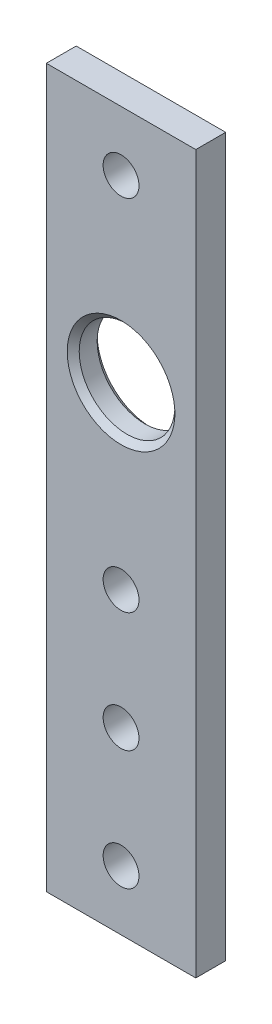
ISO-10303-21;
HEADER;
FILE_DESCRIPTION(('STEP AP214'),'2;1');
FILE_NAME('part.step','',(''),(''),'','','');
FILE_SCHEMA(('AUTOMOTIVE_DESIGN { 1 0 10303 214 1 1 1 1 }'));
ENDSEC;
DATA;
#1=APPLICATION_CONTEXT('core data for automotive mechanical design processes');
#2=APPLICATION_PROTOCOL_DEFINITION('international standard','automotive_design',2000,#1);
#3=PRODUCT_CONTEXT('',#1,'mechanical');
#4=PRODUCT('Part','Part','',(#3));
#5=PRODUCT_RELATED_PRODUCT_CATEGORY('part','',(#4));
#6=PRODUCT_DEFINITION_FORMATION('','',#4);
#7=PRODUCT_DEFINITION_CONTEXT('part definition',#1,'design');
#8=PRODUCT_DEFINITION('design','',#6,#7);
#9=PRODUCT_DEFINITION_SHAPE('','',#8);
#10=(LENGTH_UNIT() NAMED_UNIT(*) SI_UNIT(.MILLI.,.METRE.));
#11=(NAMED_UNIT(*) PLANE_ANGLE_UNIT() SI_UNIT($,.RADIAN.));
#12=(NAMED_UNIT(*) SI_UNIT($,.STERADIAN.) SOLID_ANGLE_UNIT());
#13=UNCERTAINTY_MEASURE_WITH_UNIT(LENGTH_MEASURE(1.E-05),#10,'distance_accuracy_value','');
#14=(GEOMETRIC_REPRESENTATION_CONTEXT(3) GLOBAL_UNCERTAINTY_ASSIGNED_CONTEXT((#13)) GLOBAL_UNIT_ASSIGNED_CONTEXT((#10,
#11,#12)) REPRESENTATION_CONTEXT('',''));
#15=CARTESIAN_POINT('',(0.,0.,0.));
#16=DIRECTION('',(0.,0.,1.));
#17=DIRECTION('',(1.,0.,0.));
#18=AXIS2_PLACEMENT_3D('',#15,#16,#17);
#19=CARTESIAN_POINT('',(0.,0.,5.));
#20=DIRECTION('',(0.,0.,-1.));
#21=DIRECTION('',(-1.,0.,0.));
#22=AXIS2_PLACEMENT_3D('',#19,#20,#21);
#23=PLANE('',#22);
#24=CARTESIAN_POINT('',(12.5,80.,5.));
#25=DIRECTION('',(0.,0.,-1.));
#26=DIRECTION('',(-1.,0.,0.));
#27=AXIS2_PLACEMENT_3D('',#24,#25,#26);
#28=CIRCLE('',#27,9.00000000000002);
#29=CARTESIAN_POINT('',(3.49999999999997,80.,5.));
#30=VERTEX_POINT('',#29);
#31=EDGE_CURVE('E11',#30,#30,#28,.T.);
#32=ORIENTED_EDGE('',*,*,#31,.T.);
#33=EDGE_LOOP('',(#32));
#34=FACE_BOUND('',#33,.T.);
#35=DIRECTION('',(0.,-1.,0.));
#36=VECTOR('',#35,1.);
#37=CARTESIAN_POINT('',(0.,0.,5.));
#38=LINE('',#37,#36);
#39=CARTESIAN_POINT('',(0.,120.,5.));
#40=VERTEX_POINT('',#39);
#41=CARTESIAN_POINT('',(0.,0.,5.));
#42=VERTEX_POINT('',#41);
#43=EDGE_CURVE('E96',#40,#42,#38,.T.);
#44=ORIENTED_EDGE('',*,*,#43,.T.);
#45=DIRECTION('',(1.,0.,0.));
#46=VECTOR('',#45,1.);
#47=CARTESIAN_POINT('',(0.,0.,5.));
#48=LINE('',#47,#46);
#49=CARTESIAN_POINT('',(25.,0.,5.));
#50=VERTEX_POINT('',#49);
#51=EDGE_CURVE('E91',#42,#50,#48,.T.);
#52=ORIENTED_EDGE('',*,*,#51,.T.);
#53=DIRECTION('',(0.,1.,0.));
#54=VECTOR('',#53,1.);
#55=CARTESIAN_POINT('',(25.,0.,5.));
#56=LINE('',#55,#54);
#57=CARTESIAN_POINT('',(25.,120.,5.));
#58=VERTEX_POINT('',#57);
#59=EDGE_CURVE('E94',#50,#58,#56,.T.);
#60=ORIENTED_EDGE('',*,*,#59,.T.);
#61=DIRECTION('',(-1.,0.,0.));
#62=VECTOR('',#61,1.);
#63=CARTESIAN_POINT('',(0.,120.,5.));
#64=LINE('',#63,#62);
#65=EDGE_CURVE('E60',#58,#40,#64,.T.);
#66=ORIENTED_EDGE('',*,*,#65,.T.);
#67=EDGE_LOOP('',(#44,#52,#60,#66));
#68=FACE_BOUND('',#67,.T.);
#69=CARTESIAN_POINT('',(12.5,110.,5.));
#70=DIRECTION('',(0.,0.,1.));
#71=DIRECTION('',(1.,0.,0.));
#72=AXIS2_PLACEMENT_3D('',#69,#70,#71);
#73=CIRCLE('',#72,3.);
#74=CARTESIAN_POINT('',(15.5,110.,5.));
#75=VERTEX_POINT('',#74);
#76=EDGE_CURVE('E119',#75,#75,#73,.T.);
#77=ORIENTED_EDGE('',*,*,#76,.F.);
#78=EDGE_LOOP('',(#77));
#79=FACE_BOUND('',#78,.T.);
#80=CARTESIAN_POINT('',(12.5,50.,5.));
#81=DIRECTION('',(0.,0.,1.));
#82=DIRECTION('',(1.,0.,0.));
#83=AXIS2_PLACEMENT_3D('',#80,#81,#82);
#84=CIRCLE('',#83,3.);
#85=CARTESIAN_POINT('',(15.5,50.,5.));
#86=VERTEX_POINT('',#85);
#87=EDGE_CURVE('E188',#86,#86,#84,.T.);
#88=ORIENTED_EDGE('',*,*,#87,.F.);
#89=EDGE_LOOP('',(#88));
#90=FACE_BOUND('',#89,.T.);
#91=CARTESIAN_POINT('',(12.5,30.,5.));
#92=DIRECTION('',(0.,0.,1.));
#93=DIRECTION('',(1.,0.,0.));
#94=AXIS2_PLACEMENT_3D('',#91,#92,#93);
#95=CIRCLE('',#94,3.);
#96=CARTESIAN_POINT('',(15.5,30.,5.));
#97=VERTEX_POINT('',#96);
#98=EDGE_CURVE('E182',#97,#97,#95,.T.);
#99=ORIENTED_EDGE('',*,*,#98,.F.);
#100=EDGE_LOOP('',(#99));
#101=FACE_BOUND('',#100,.T.);
#102=CARTESIAN_POINT('',(12.5,10.,5.));
#103=DIRECTION('',(0.,0.,1.));
#104=DIRECTION('',(1.,0.,0.));
#105=AXIS2_PLACEMENT_3D('',#102,#103,#104);
#106=CIRCLE('',#105,3.);
#107=CARTESIAN_POINT('',(15.5,10.,5.));
#108=VERTEX_POINT('',#107);
#109=EDGE_CURVE('E176',#108,#108,#106,.T.);
#110=ORIENTED_EDGE('',*,*,#109,.F.);
#111=EDGE_LOOP('',(#110));
#112=FACE_BOUND('',#111,.T.);
#113=ADVANCED_FACE('F41',(#34,#68,#79,#90,#101,#112),#23,.F.);
#114=CARTESIAN_POINT('',(0.,0.,0.));
#115=DIRECTION('',(0.,0.,-1.));
#116=DIRECTION('',(-1.,0.,0.));
#117=AXIS2_PLACEMENT_3D('',#114,#115,#116);
#118=PLANE('',#117);
#119=CARTESIAN_POINT('',(12.5,80.,0.));
#120=DIRECTION('',(0.,0.,-1.));
#121=DIRECTION('',(-1.,0.,0.));
#122=AXIS2_PLACEMENT_3D('',#119,#120,#121);
#123=CIRCLE('',#122,9.00000000000001);
#124=CARTESIAN_POINT('',(3.49999999999999,80.,0.));
#125=VERTEX_POINT('',#124);
#126=EDGE_CURVE('E132',#125,#125,#123,.F.);
#127=ORIENTED_EDGE('',*,*,#126,.T.);
#128=EDGE_LOOP('',(#127));
#129=FACE_BOUND('',#128,.T.);
#130=CARTESIAN_POINT('',(12.5,30.,0.));
#131=DIRECTION('',(0.,0.,1.));
#132=DIRECTION('',(1.,0.,0.));
#133=AXIS2_PLACEMENT_3D('',#130,#131,#132);
#134=CIRCLE('',#133,3.);
#135=CARTESIAN_POINT('',(15.5,30.,0.));
#136=VERTEX_POINT('',#135);
#137=EDGE_CURVE('E160',#136,#136,#134,.T.);
#138=ORIENTED_EDGE('',*,*,#137,.T.);
#139=EDGE_LOOP('',(#138));
#140=FACE_BOUND('',#139,.T.);
#141=DIRECTION('',(0.,-1.,0.));
#142=VECTOR('',#141,1.);
#143=CARTESIAN_POINT('',(0.,0.,0.));
#144=LINE('',#143,#142);
#145=CARTESIAN_POINT('',(0.,120.,0.));
#146=VERTEX_POINT('',#145);
#147=CARTESIAN_POINT('',(0.,0.,0.));
#148=VERTEX_POINT('',#147);
#149=EDGE_CURVE('E115',#146,#148,#144,.T.);
#150=ORIENTED_EDGE('',*,*,#149,.F.);
#151=DIRECTION('',(-1.,0.,0.));
#152=VECTOR('',#151,1.);
#153=CARTESIAN_POINT('',(0.,120.,0.));
#154=LINE('',#153,#152);
#155=CARTESIAN_POINT('',(25.,120.,0.));
#156=VERTEX_POINT('',#155);
#157=EDGE_CURVE('E83',#156,#146,#154,.T.);
#158=ORIENTED_EDGE('',*,*,#157,.F.);
#159=DIRECTION('',(0.,1.,0.));
#160=VECTOR('',#159,1.);
#161=CARTESIAN_POINT('',(25.,0.,0.));
#162=LINE('',#161,#160);
#163=CARTESIAN_POINT('',(25.,0.,0.));
#164=VERTEX_POINT('',#163);
#165=EDGE_CURVE('E77',#164,#156,#162,.T.);
#166=ORIENTED_EDGE('',*,*,#165,.F.);
#167=DIRECTION('',(1.,0.,0.));
#168=VECTOR('',#167,1.);
#169=CARTESIAN_POINT('',(0.,0.,0.));
#170=LINE('',#169,#168);
#171=EDGE_CURVE('E102',#148,#164,#170,.T.);
#172=ORIENTED_EDGE('',*,*,#171,.F.);
#173=EDGE_LOOP('',(#150,#158,#166,#172));
#174=FACE_BOUND('',#173,.T.);
#175=CARTESIAN_POINT('',(12.5,110.,0.));
#176=DIRECTION('',(0.,0.,1.));
#177=DIRECTION('',(1.,0.,0.));
#178=AXIS2_PLACEMENT_3D('',#175,#176,#177);
#179=CIRCLE('',#178,3.);
#180=CARTESIAN_POINT('',(15.5,110.,0.));
#181=VERTEX_POINT('',#180);
#182=EDGE_CURVE('E166',#181,#181,#179,.T.);
#183=ORIENTED_EDGE('',*,*,#182,.T.);
#184=EDGE_LOOP('',(#183));
#185=FACE_BOUND('',#184,.T.);
#186=CARTESIAN_POINT('',(12.5,50.,0.));
#187=DIRECTION('',(0.,0.,1.));
#188=DIRECTION('',(1.,0.,0.));
#189=AXIS2_PLACEMENT_3D('',#186,#187,#188);
#190=CIRCLE('',#189,3.);
#191=CARTESIAN_POINT('',(15.5,50.,0.));
#192=VERTEX_POINT('',#191);
#193=EDGE_CURVE('E170',#192,#192,#190,.T.);
#194=ORIENTED_EDGE('',*,*,#193,.T.);
#195=EDGE_LOOP('',(#194));
#196=FACE_BOUND('',#195,.T.);
#197=CARTESIAN_POINT('',(12.5,10.,0.));
#198=DIRECTION('',(0.,0.,1.));
#199=DIRECTION('',(1.,0.,0.));
#200=AXIS2_PLACEMENT_3D('',#197,#198,#199);
#201=CIRCLE('',#200,3.);
#202=CARTESIAN_POINT('',(15.5,10.,0.));
#203=VERTEX_POINT('',#202);
#204=EDGE_CURVE('E173',#203,#203,#201,.T.);
#205=ORIENTED_EDGE('',*,*,#204,.T.);
#206=EDGE_LOOP('',(#205));
#207=FACE_BOUND('',#206,.T.);
#208=ADVANCED_FACE('F152',(#129,#140,#174,#185,#196,#207),#118,.T.);
#209=CARTESIAN_POINT('',(0.,0.,5.));
#210=DIRECTION('',(1.,0.,0.));
#211=DIRECTION('',(0.,0.,-1.));
#212=AXIS2_PLACEMENT_3D('',#209,#210,#211);
#213=PLANE('',#212);
#214=ORIENTED_EDGE('',*,*,#149,.T.);
#215=DIRECTION('',(0.,0.,-1.));
#216=VECTOR('',#215,1.);
#217=CARTESIAN_POINT('',(0.,0.,5.));
#218=LINE('',#217,#216);
#219=EDGE_CURVE('E104',#42,#148,#218,.T.);
#220=ORIENTED_EDGE('',*,*,#219,.F.);
#221=ORIENTED_EDGE('',*,*,#43,.F.);
#222=DIRECTION('',(0.,0.,-1.));
#223=VECTOR('',#222,1.);
#224=CARTESIAN_POINT('',(0.,120.,5.));
#225=LINE('',#224,#223);
#226=EDGE_CURVE('E111',#40,#146,#225,.T.);
#227=ORIENTED_EDGE('',*,*,#226,.T.);
#228=EDGE_LOOP('',(#214,#220,#221,#227));
#229=FACE_BOUND('',#228,.T.);
#230=ADVANCED_FACE('F155',(#229),#213,.F.);
#231=CARTESIAN_POINT('',(0.,0.,5.));
#232=DIRECTION('',(0.,1.,0.));
#233=DIRECTION('',(0.,0.,1.));
#234=AXIS2_PLACEMENT_3D('',#231,#232,#233);
#235=PLANE('',#234);
#236=ORIENTED_EDGE('',*,*,#171,.T.);
#237=DIRECTION('',(0.,0.,-1.));
#238=VECTOR('',#237,1.);
#239=CARTESIAN_POINT('',(25.,0.,5.));
#240=LINE('',#239,#238);
#241=EDGE_CURVE('E100',#50,#164,#240,.T.);
#242=ORIENTED_EDGE('',*,*,#241,.F.);
#243=ORIENTED_EDGE('',*,*,#51,.F.);
#244=ORIENTED_EDGE('',*,*,#219,.T.);
#245=EDGE_LOOP('',(#236,#242,#243,#244));
#246=FACE_BOUND('',#245,.T.);
#247=ADVANCED_FACE('F101',(#246),#235,.F.);
#248=CARTESIAN_POINT('',(25.,0.,5.));
#249=DIRECTION('',(-1.,0.,0.));
#250=DIRECTION('',(0.,0.,1.));
#251=AXIS2_PLACEMENT_3D('',#248,#249,#250);
#252=PLANE('',#251);
#253=ORIENTED_EDGE('',*,*,#165,.T.);
#254=DIRECTION('',(0.,0.,-1.));
#255=VECTOR('',#254,1.);
#256=CARTESIAN_POINT('',(25.,120.,5.));
#257=LINE('',#256,#255);
#258=EDGE_CURVE('E105',#58,#156,#257,.T.);
#259=ORIENTED_EDGE('',*,*,#258,.F.);
#260=ORIENTED_EDGE('',*,*,#59,.F.);
#261=ORIENTED_EDGE('',*,*,#241,.T.);
#262=EDGE_LOOP('',(#253,#259,#260,#261));
#263=FACE_BOUND('',#262,.T.);
#264=ADVANCED_FACE('F107',(#263),#252,.F.);
#265=CARTESIAN_POINT('',(0.,120.,5.));
#266=DIRECTION('',(0.,-1.,0.));
#267=DIRECTION('',(0.,0.,-1.));
#268=AXIS2_PLACEMENT_3D('',#265,#266,#267);
#269=PLANE('',#268);
#270=ORIENTED_EDGE('',*,*,#157,.T.);
#271=ORIENTED_EDGE('',*,*,#226,.F.);
#272=ORIENTED_EDGE('',*,*,#65,.F.);
#273=ORIENTED_EDGE('',*,*,#258,.T.);
#274=EDGE_LOOP('',(#270,#271,#272,#273));
#275=FACE_BOUND('',#274,.T.);
#276=ADVANCED_FACE('F229',(#275),#269,.F.);
#277=CARTESIAN_POINT('',(12.5,110.,5.));
#278=DIRECTION('',(0.,0.,-1.));
#279=DIRECTION('',(-1.,0.,0.));
#280=AXIS2_PLACEMENT_3D('',#277,#278,#279);
#281=CYLINDRICAL_SURFACE('',#280,3.);
#282=ORIENTED_EDGE('',*,*,#76,.T.);
#283=EDGE_LOOP('',(#282));
#284=FACE_BOUND('',#283,.T.);
#285=ORIENTED_EDGE('',*,*,#182,.F.);
#286=EDGE_LOOP('',(#285));
#287=FACE_BOUND('',#286,.T.);
#288=ADVANCED_FACE('F201',(#284,#287),#281,.F.);
#289=CARTESIAN_POINT('',(12.5,80.,5.));
#290=DIRECTION('',(0.,0.,-1.));
#291=DIRECTION('',(-1.,0.,0.));
#292=AXIS2_PLACEMENT_3D('',#289,#290,#291);
#293=CYLINDRICAL_SURFACE('',#292,8.00000000000001);
#294=CARTESIAN_POINT('',(12.5,80.,1.00000000000002));
#295=DIRECTION('',(0.,0.,-1.));
#296=DIRECTION('',(-1.,0.,0.));
#297=AXIS2_PLACEMENT_3D('',#294,#295,#296);
#298=CIRCLE('',#297,8.00000000000001);
#299=CARTESIAN_POINT('',(4.49999999999999,80.,1.00000000000002));
#300=VERTEX_POINT('',#299);
#301=EDGE_CURVE('E52',#300,#300,#298,.T.);
#302=ORIENTED_EDGE('',*,*,#301,.T.);
#303=EDGE_LOOP('',(#302));
#304=FACE_BOUND('',#303,.T.);
#305=CARTESIAN_POINT('',(12.5,80.,3.99999999999997));
#306=DIRECTION('',(0.,0.,-1.));
#307=DIRECTION('',(-1.,0.,0.));
#308=AXIS2_PLACEMENT_3D('',#305,#306,#307);
#309=CIRCLE('',#308,8.00000000000001);
#310=CARTESIAN_POINT('',(4.49999999999999,80.,3.99999999999997));
#311=VERTEX_POINT('',#310);
#312=EDGE_CURVE('E136',#311,#311,#309,.F.);
#313=ORIENTED_EDGE('',*,*,#312,.T.);
#314=EDGE_LOOP('',(#313));
#315=FACE_BOUND('',#314,.T.);
#316=ADVANCED_FACE('F143',(#304,#315),#293,.F.);
#317=CARTESIAN_POINT('',(12.5,50.,5.));
#318=DIRECTION('',(0.,0.,-1.));
#319=DIRECTION('',(-1.,0.,0.));
#320=AXIS2_PLACEMENT_3D('',#317,#318,#319);
#321=CYLINDRICAL_SURFACE('',#320,3.);
#322=ORIENTED_EDGE('',*,*,#87,.T.);
#323=EDGE_LOOP('',(#322));
#324=FACE_BOUND('',#323,.T.);
#325=ORIENTED_EDGE('',*,*,#193,.F.);
#326=EDGE_LOOP('',(#325));
#327=FACE_BOUND('',#326,.T.);
#328=ADVANCED_FACE('F219',(#324,#327),#321,.F.);
#329=CARTESIAN_POINT('',(12.5,30.,5.));
#330=DIRECTION('',(0.,0.,-1.));
#331=DIRECTION('',(-1.,0.,0.));
#332=AXIS2_PLACEMENT_3D('',#329,#330,#331);
#333=CYLINDRICAL_SURFACE('',#332,3.);
#334=ORIENTED_EDGE('',*,*,#98,.T.);
#335=EDGE_LOOP('',(#334));
#336=FACE_BOUND('',#335,.T.);
#337=ORIENTED_EDGE('',*,*,#137,.F.);
#338=EDGE_LOOP('',(#337));
#339=FACE_BOUND('',#338,.T.);
#340=ADVANCED_FACE('F214',(#336,#339),#333,.F.);
#341=CARTESIAN_POINT('',(12.5,10.,5.));
#342=DIRECTION('',(0.,0.,-1.));
#343=DIRECTION('',(-1.,0.,0.));
#344=AXIS2_PLACEMENT_3D('',#341,#342,#343);
#345=CYLINDRICAL_SURFACE('',#344,3.);
#346=ORIENTED_EDGE('',*,*,#109,.T.);
#347=EDGE_LOOP('',(#346));
#348=FACE_BOUND('',#347,.T.);
#349=ORIENTED_EDGE('',*,*,#204,.F.);
#350=EDGE_LOOP('',(#349));
#351=FACE_BOUND('',#350,.T.);
#352=ADVANCED_FACE('F149',(#348,#351),#345,.F.);
#353=CARTESIAN_POINT('',(12.5,80.,0.));
#354=DIRECTION('',(0.,0.,-1.));
#355=DIRECTION('',(-1.,0.,0.));
#356=AXIS2_PLACEMENT_3D('',#353,#354,#355);
#357=CONICAL_SURFACE('',#356,9.00000000000001,0.785398163397441);
#358=ORIENTED_EDGE('',*,*,#301,.F.);
#359=EDGE_LOOP('',(#358));
#360=FACE_BOUND('',#359,.T.);
#361=ORIENTED_EDGE('',*,*,#126,.F.);
#362=EDGE_LOOP('',(#361));
#363=FACE_BOUND('',#362,.T.);
#364=ADVANCED_FACE('F146',(#360,#363),#357,.F.);
#365=CARTESIAN_POINT('',(12.5,80.,3.99999999999997));
#366=DIRECTION('',(0.,0.,1.));
#367=DIRECTION('',(1.,0.,0.));
#368=AXIS2_PLACEMENT_3D('',#365,#366,#367);
#369=CONICAL_SURFACE('',#368,8.00000000000001,0.785398163397441);
#370=ORIENTED_EDGE('',*,*,#31,.F.);
#371=EDGE_LOOP('',(#370));
#372=FACE_BOUND('',#371,.T.);
#373=ORIENTED_EDGE('',*,*,#312,.F.);
#374=EDGE_LOOP('',(#373));
#375=FACE_BOUND('',#374,.T.);
#376=ADVANCED_FACE('F44',(#372,#375),#369,.F.);
#377=CLOSED_SHELL('',(#113,#208,#230,#247,#264,#276,#288,#316,#328,#340,#352,#364,#376));
#378=MANIFOLD_SOLID_BREP('B2',#377);
#379=ADVANCED_BREP_SHAPE_REPRESENTATION('',(#18,#378),#14);
#380=SHAPE_DEFINITION_REPRESENTATION(#9,#379);
ENDSEC;
END-ISO-10303-21;
